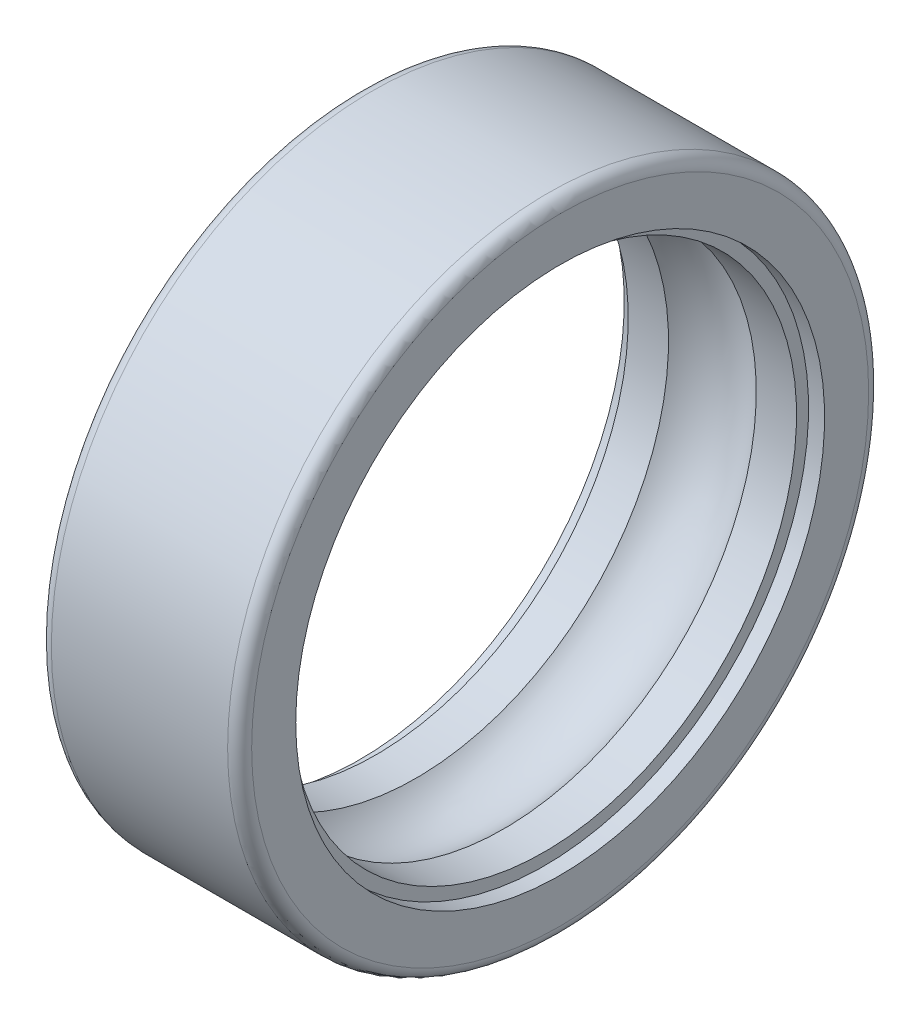
ISO-10303-21;
HEADER;
FILE_DESCRIPTION(('STEP AP214'),'2;1');
FILE_NAME('part.step','',(''),(''),'','','');
FILE_SCHEMA(('AUTOMOTIVE_DESIGN { 1 0 10303 214 1 1 1 1 }'));
ENDSEC;
DATA;
#1=APPLICATION_CONTEXT('core data for automotive mechanical design processes');
#2=APPLICATION_PROTOCOL_DEFINITION('international standard','automotive_design',2000,#1);
#3=PRODUCT_CONTEXT('',#1,'mechanical');
#4=PRODUCT('Part','Part','',(#3));
#5=PRODUCT_RELATED_PRODUCT_CATEGORY('part','',(#4));
#6=PRODUCT_DEFINITION_FORMATION('','',#4);
#7=PRODUCT_DEFINITION_CONTEXT('part definition',#1,'design');
#8=PRODUCT_DEFINITION('design','',#6,#7);
#9=PRODUCT_DEFINITION_SHAPE('','',#8);
#10=(LENGTH_UNIT() NAMED_UNIT(*) SI_UNIT(.MILLI.,.METRE.));
#11=(NAMED_UNIT(*) PLANE_ANGLE_UNIT() SI_UNIT($,.RADIAN.));
#12=(NAMED_UNIT(*) SI_UNIT($,.STERADIAN.) SOLID_ANGLE_UNIT());
#13=UNCERTAINTY_MEASURE_WITH_UNIT(LENGTH_MEASURE(1.E-05),#10,'distance_accuracy_value','');
#14=(GEOMETRIC_REPRESENTATION_CONTEXT(3) GLOBAL_UNCERTAINTY_ASSIGNED_CONTEXT((#13)) GLOBAL_UNIT_ASSIGNED_CONTEXT((#10,
#11,#12)) REPRESENTATION_CONTEXT('',''));
#15=CARTESIAN_POINT('',(0.,0.,0.));
#16=DIRECTION('',(0.,0.,1.));
#17=DIRECTION('',(1.,0.,0.));
#18=AXIS2_PLACEMENT_3D('',#15,#16,#17);
#19=CARTESIAN_POINT('',(2.5,0.,0.));
#20=DIRECTION('',(-1.,0.,0.));
#21=DIRECTION('',(0.,-1.,0.));
#22=AXIS2_PLACEMENT_3D('',#19,#20,#21);
#23=TOROIDAL_SURFACE('',#22,5.275,1.5);
#24=CARTESIAN_POINT('',(1.40484019430953,0.,0.));
#25=DIRECTION('',(1.,0.,0.));
#26=DIRECTION('',(0.,0.,1.));
#27=AXIS2_PLACEMENT_3D('',#24,#25,#26);
#28=CIRCLE('',#27,6.3);
#29=CARTESIAN_POINT('',(1.40484019430953,0.,6.3));
#30=VERTEX_POINT('',#29);
#31=EDGE_CURVE('E141',#30,#30,#28,.T.);
#32=ORIENTED_EDGE('',*,*,#31,.F.);
#33=EDGE_LOOP('',(#32));
#34=FACE_BOUND('',#33,.T.);
#35=CARTESIAN_POINT('',(3.59515980569047,0.,0.));
#36=DIRECTION('',(1.,0.,0.));
#37=DIRECTION('',(0.,0.,1.));
#38=AXIS2_PLACEMENT_3D('',#35,#36,#37);
#39=CIRCLE('',#38,6.3);
#40=CARTESIAN_POINT('',(3.59515980569047,0.,6.3));
#41=VERTEX_POINT('',#40);
#42=EDGE_CURVE('E130',#41,#41,#39,.F.);
#43=ORIENTED_EDGE('',*,*,#42,.F.);
#44=EDGE_LOOP('',(#43));
#45=FACE_BOUND('',#44,.T.);
#46=ADVANCED_FACE('F14',(#34,#45),#23,.F.);
#47=CARTESIAN_POINT('',(4.6,0.,0.));
#48=DIRECTION('',(-1.,0.,0.));
#49=DIRECTION('',(0.,0.,1.));
#50=AXIS2_PLACEMENT_3D('',#47,#48,#49);
#51=CYLINDRICAL_SURFACE('',#50,6.3);
#52=CARTESIAN_POINT('',(4.6,0.,0.));
#53=DIRECTION('',(-1.,0.,0.));
#54=DIRECTION('',(0.,0.,1.));
#55=AXIS2_PLACEMENT_3D('',#52,#53,#54);
#56=CIRCLE('',#55,6.3);
#57=CARTESIAN_POINT('',(4.6,0.,6.3));
#58=VERTEX_POINT('',#57);
#59=EDGE_CURVE('E18',#58,#58,#56,.T.);
#60=ORIENTED_EDGE('',*,*,#59,.F.);
#61=EDGE_LOOP('',(#60));
#62=FACE_BOUND('',#61,.T.);
#63=ORIENTED_EDGE('',*,*,#42,.T.);
#64=EDGE_LOOP('',(#63));
#65=FACE_BOUND('',#64,.T.);
#66=ADVANCED_FACE('F97',(#62,#65),#51,.F.);
#67=CARTESIAN_POINT('',(1.40484019430953,0.,0.));
#68=DIRECTION('',(-1.,0.,0.));
#69=DIRECTION('',(0.,0.,1.));
#70=AXIS2_PLACEMENT_3D('',#67,#68,#69);
#71=CYLINDRICAL_SURFACE('',#70,6.3);
#72=ORIENTED_EDGE('',*,*,#31,.T.);
#73=EDGE_LOOP('',(#72));
#74=FACE_BOUND('',#73,.T.);
#75=CARTESIAN_POINT('',(0.4,0.,0.));
#76=DIRECTION('',(-1.,0.,0.));
#77=DIRECTION('',(0.,0.,1.));
#78=AXIS2_PLACEMENT_3D('',#75,#76,#77);
#79=CIRCLE('',#78,6.3);
#80=CARTESIAN_POINT('',(0.4,0.,6.3));
#81=VERTEX_POINT('',#80);
#82=EDGE_CURVE('E136',#81,#81,#79,.F.);
#83=ORIENTED_EDGE('',*,*,#82,.F.);
#84=EDGE_LOOP('',(#83));
#85=FACE_BOUND('',#84,.T.);
#86=ADVANCED_FACE('F94',(#74,#85),#71,.F.);
#87=CARTESIAN_POINT('',(4.6,0.,6.45));
#88=DIRECTION('',(1.,0.,0.));
#89=DIRECTION('',(0.,0.,-1.));
#90=AXIS2_PLACEMENT_3D('',#87,#88,#89);
#91=PLANE('',#90);
#92=ORIENTED_EDGE('',*,*,#59,.T.);
#93=EDGE_LOOP('',(#92));
#94=FACE_BOUND('',#93,.T.);
#95=CARTESIAN_POINT('',(4.6,0.,0.));
#96=DIRECTION('',(-1.,0.,0.));
#97=DIRECTION('',(0.,0.,1.));
#98=AXIS2_PLACEMENT_3D('',#95,#96,#97);
#99=CIRCLE('',#98,6.6);
#100=CARTESIAN_POINT('',(4.6,0.,6.6));
#101=VERTEX_POINT('',#100);
#102=EDGE_CURVE('E134',#101,#101,#99,.T.);
#103=ORIENTED_EDGE('',*,*,#102,.F.);
#104=EDGE_LOOP('',(#103));
#105=FACE_BOUND('',#104,.T.);
#106=ADVANCED_FACE('F90',(#94,#105),#91,.T.);
#107=CARTESIAN_POINT('',(0.4,0.,6.45));
#108=DIRECTION('',(-1.,0.,0.));
#109=DIRECTION('',(0.,0.,1.));
#110=AXIS2_PLACEMENT_3D('',#107,#108,#109);
#111=PLANE('',#110);
#112=CARTESIAN_POINT('',(0.4,0.,0.));
#113=DIRECTION('',(-1.,0.,0.));
#114=DIRECTION('',(0.,0.,1.));
#115=AXIS2_PLACEMENT_3D('',#112,#113,#114);
#116=CIRCLE('',#115,6.6);
#117=CARTESIAN_POINT('',(0.4,0.,6.6));
#118=VERTEX_POINT('',#117);
#119=EDGE_CURVE('E127',#118,#118,#116,.F.);
#120=ORIENTED_EDGE('',*,*,#119,.F.);
#121=EDGE_LOOP('',(#120));
#122=FACE_BOUND('',#121,.T.);
#123=ORIENTED_EDGE('',*,*,#82,.T.);
#124=EDGE_LOOP('',(#123));
#125=FACE_BOUND('',#124,.T.);
#126=ADVANCED_FACE('F86',(#122,#125),#111,.T.);
#127=CARTESIAN_POINT('',(5.,0.,0.));
#128=DIRECTION('',(-1.,0.,0.));
#129=DIRECTION('',(0.,0.,1.));
#130=AXIS2_PLACEMENT_3D('',#127,#128,#129);
#131=CYLINDRICAL_SURFACE('',#130,6.6);
#132=CARTESIAN_POINT('',(5.,0.,0.));
#133=DIRECTION('',(-1.,0.,0.));
#134=DIRECTION('',(0.,0.,1.));
#135=AXIS2_PLACEMENT_3D('',#132,#133,#134);
#136=CIRCLE('',#135,6.6);
#137=CARTESIAN_POINT('',(5.,0.,6.6));
#138=VERTEX_POINT('',#137);
#139=EDGE_CURVE('E122',#138,#138,#136,.T.);
#140=ORIENTED_EDGE('',*,*,#139,.F.);
#141=EDGE_LOOP('',(#140));
#142=FACE_BOUND('',#141,.T.);
#143=ORIENTED_EDGE('',*,*,#102,.T.);
#144=EDGE_LOOP('',(#143));
#145=FACE_BOUND('',#144,.T.);
#146=ADVANCED_FACE('F82',(#142,#145),#131,.F.);
#147=CARTESIAN_POINT('',(0.4,0.,0.));
#148=DIRECTION('',(-1.,0.,0.));
#149=DIRECTION('',(0.,0.,1.));
#150=AXIS2_PLACEMENT_3D('',#147,#148,#149);
#151=CYLINDRICAL_SURFACE('',#150,6.6);
#152=ORIENTED_EDGE('',*,*,#119,.T.);
#153=EDGE_LOOP('',(#152));
#154=FACE_BOUND('',#153,.T.);
#155=CARTESIAN_POINT('',(0.,0.,0.));
#156=DIRECTION('',(-1.,0.,0.));
#157=DIRECTION('',(0.,0.,1.));
#158=AXIS2_PLACEMENT_3D('',#155,#156,#157);
#159=CIRCLE('',#158,6.6);
#160=CARTESIAN_POINT('',(0.,0.,6.6));
#161=VERTEX_POINT('',#160);
#162=EDGE_CURVE('E120',#161,#161,#159,.F.);
#163=ORIENTED_EDGE('',*,*,#162,.F.);
#164=EDGE_LOOP('',(#163));
#165=FACE_BOUND('',#164,.T.);
#166=ADVANCED_FACE('F77',(#154,#165),#151,.F.);
#167=CARTESIAN_POINT('',(5.,0.,7.15));
#168=DIRECTION('',(1.,0.,0.));
#169=DIRECTION('',(0.,0.,-1.));
#170=AXIS2_PLACEMENT_3D('',#167,#168,#169);
#171=PLANE('',#170);
#172=ORIENTED_EDGE('',*,*,#139,.T.);
#173=EDGE_LOOP('',(#172));
#174=FACE_BOUND('',#173,.T.);
#175=CARTESIAN_POINT('',(5.,0.,0.));
#176=DIRECTION('',(-1.,0.,0.));
#177=DIRECTION('',(0.,0.,1.));
#178=AXIS2_PLACEMENT_3D('',#175,#176,#177);
#179=CIRCLE('',#178,7.7);
#180=CARTESIAN_POINT('',(5.,0.,7.7));
#181=VERTEX_POINT('',#180);
#182=EDGE_CURVE('E61',#181,#181,#179,.T.);
#183=ORIENTED_EDGE('',*,*,#182,.F.);
#184=EDGE_LOOP('',(#183));
#185=FACE_BOUND('',#184,.T.);
#186=ADVANCED_FACE('F67',(#174,#185),#171,.T.);
#187=CARTESIAN_POINT('',(0.,0.,7.15));
#188=DIRECTION('',(-1.,0.,0.));
#189=DIRECTION('',(0.,0.,1.));
#190=AXIS2_PLACEMENT_3D('',#187,#188,#189);
#191=PLANE('',#190);
#192=CARTESIAN_POINT('',(0.,0.,0.));
#193=DIRECTION('',(1.,0.,0.));
#194=DIRECTION('',(0.,0.,1.));
#195=AXIS2_PLACEMENT_3D('',#192,#193,#194);
#196=CIRCLE('',#195,7.7);
#197=CARTESIAN_POINT('',(0.,0.,7.7));
#198=VERTEX_POINT('',#197);
#199=EDGE_CURVE('E27',#198,#198,#196,.T.);
#200=ORIENTED_EDGE('',*,*,#199,.F.);
#201=EDGE_LOOP('',(#200));
#202=FACE_BOUND('',#201,.T.);
#203=ORIENTED_EDGE('',*,*,#162,.T.);
#204=EDGE_LOOP('',(#203));
#205=FACE_BOUND('',#204,.T.);
#206=ADVANCED_FACE('F76',(#202,#205),#191,.T.);
#207=CARTESIAN_POINT('',(4.7,0.,0.));
#208=DIRECTION('',(-1.,0.,0.));
#209=DIRECTION('',(0.,-1.,0.));
#210=AXIS2_PLACEMENT_3D('',#207,#208,#209);
#211=TOROIDAL_SURFACE('',#210,7.7,0.300000000000001);
#212=ORIENTED_EDGE('',*,*,#182,.T.);
#213=EDGE_LOOP('',(#212));
#214=FACE_BOUND('',#213,.T.);
#215=CARTESIAN_POINT('',(4.7,0.,0.));
#216=DIRECTION('',(-1.,0.,0.));
#217=DIRECTION('',(0.,0.,1.));
#218=AXIS2_PLACEMENT_3D('',#215,#216,#217);
#219=CIRCLE('',#218,8.);
#220=CARTESIAN_POINT('',(4.7,0.,8.));
#221=VERTEX_POINT('',#220);
#222=EDGE_CURVE('E22',#221,#221,#219,.T.);
#223=ORIENTED_EDGE('',*,*,#222,.F.);
#224=EDGE_LOOP('',(#223));
#225=FACE_BOUND('',#224,.T.);
#226=ADVANCED_FACE('F41',(#214,#225),#211,.T.);
#227=CARTESIAN_POINT('',(0.3,0.,0.));
#228=DIRECTION('',(-1.,0.,0.));
#229=DIRECTION('',(0.,-1.,0.));
#230=AXIS2_PLACEMENT_3D('',#227,#228,#229);
#231=TOROIDAL_SURFACE('',#230,7.7,0.3);
#232=CARTESIAN_POINT('',(0.3,0.,0.));
#233=DIRECTION('',(-1.,0.,0.));
#234=DIRECTION('',(0.,0.,1.));
#235=AXIS2_PLACEMENT_3D('',#232,#233,#234);
#236=CIRCLE('',#235,8.);
#237=CARTESIAN_POINT('',(0.3,0.,8.));
#238=VERTEX_POINT('',#237);
#239=EDGE_CURVE('E10',#238,#238,#236,.F.);
#240=ORIENTED_EDGE('',*,*,#239,.F.);
#241=EDGE_LOOP('',(#240));
#242=FACE_BOUND('',#241,.T.);
#243=ORIENTED_EDGE('',*,*,#199,.T.);
#244=EDGE_LOOP('',(#243));
#245=FACE_BOUND('',#244,.T.);
#246=ADVANCED_FACE('F35',(#242,#245),#231,.T.);
#247=CARTESIAN_POINT('',(2.5,0.,0.));
#248=DIRECTION('',(-1.,0.,0.));
#249=DIRECTION('',(0.,0.,1.));
#250=AXIS2_PLACEMENT_3D('',#247,#248,#249);
#251=CYLINDRICAL_SURFACE('',#250,8.);
#252=ORIENTED_EDGE('',*,*,#222,.T.);
#253=EDGE_LOOP('',(#252));
#254=FACE_BOUND('',#253,.T.);
#255=ORIENTED_EDGE('',*,*,#239,.T.);
#256=EDGE_LOOP('',(#255));
#257=FACE_BOUND('',#256,.T.);
#258=ADVANCED_FACE('F40',(#254,#257),#251,.T.);
#259=CLOSED_SHELL('',(#46,#66,#86,#106,#126,#146,#166,#186,#206,#226,#246,#258));
#260=MANIFOLD_SOLID_BREP('B1',#259);
#261=ADVANCED_BREP_SHAPE_REPRESENTATION('',(#18,#260),#14);
#262=SHAPE_DEFINITION_REPRESENTATION(#9,#261);
ENDSEC;
END-ISO-10303-21;
